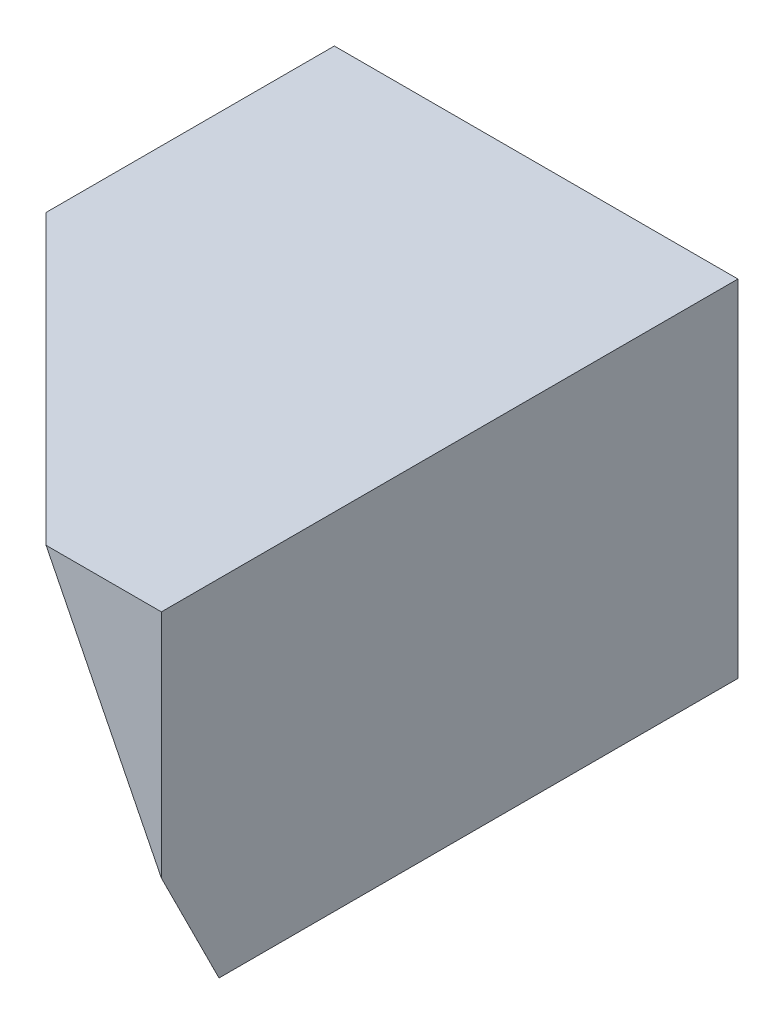
ISO-10303-21;
HEADER;
FILE_DESCRIPTION(('STEP AP214'),'2;1');
FILE_NAME('part.step','',(''),(''),'','','');
FILE_SCHEMA(('AUTOMOTIVE_DESIGN { 1 0 10303 214 1 1 1 1 }'));
ENDSEC;
DATA;
#1=APPLICATION_CONTEXT('core data for automotive mechanical design processes');
#2=APPLICATION_PROTOCOL_DEFINITION('international standard','automotive_design',2000,#1);
#3=PRODUCT_CONTEXT('',#1,'mechanical');
#4=PRODUCT('Part','Part','',(#3));
#5=PRODUCT_RELATED_PRODUCT_CATEGORY('part','',(#4));
#6=PRODUCT_DEFINITION_FORMATION('','',#4);
#7=PRODUCT_DEFINITION_CONTEXT('part definition',#1,'design');
#8=PRODUCT_DEFINITION('design','',#6,#7);
#9=PRODUCT_DEFINITION_SHAPE('','',#8);
#10=(LENGTH_UNIT() NAMED_UNIT(*) SI_UNIT(.MILLI.,.METRE.));
#11=(NAMED_UNIT(*) PLANE_ANGLE_UNIT() SI_UNIT($,.RADIAN.));
#12=(NAMED_UNIT(*) SI_UNIT($,.STERADIAN.) SOLID_ANGLE_UNIT());
#13=UNCERTAINTY_MEASURE_WITH_UNIT(LENGTH_MEASURE(1.E-05),#10,'distance_accuracy_value','');
#14=(GEOMETRIC_REPRESENTATION_CONTEXT(3) GLOBAL_UNCERTAINTY_ASSIGNED_CONTEXT((#13)) GLOBAL_UNIT_ASSIGNED_CONTEXT((#10,
#11,#12)) REPRESENTATION_CONTEXT('',''));
#15=CARTESIAN_POINT('',(0.,0.,0.));
#16=DIRECTION('',(0.,0.,1.));
#17=DIRECTION('',(1.,0.,0.));
#18=AXIS2_PLACEMENT_3D('',#15,#16,#17);
#19=CARTESIAN_POINT('',(0.,0.,5.));
#20=DIRECTION('',(1.,0.,0.));
#21=DIRECTION('',(0.,1.,0.));
#22=AXIS2_PLACEMENT_3D('',#19,#20,#21);
#23=PLANE('',#22);
#24=DIRECTION('',(0.,-0.894427190999916,-0.447213595499957));
#25=VECTOR('',#24,1.);
#26=CARTESIAN_POINT('',(0.,0.,0.));
#27=LINE('',#26,#25);
#28=CARTESIAN_POINT('',(0.,0.,0.));
#29=VERTEX_POINT('',#28);
#30=CARTESIAN_POINT('',(0.,-4.,-2.));
#31=VERTEX_POINT('',#30);
#32=EDGE_CURVE('E159',#29,#31,#27,.T.);
#33=ORIENTED_EDGE('',*,*,#32,.F.);
#34=DIRECTION('',(0.,0.,-1.));
#35=VECTOR('',#34,1.);
#36=CARTESIAN_POINT('',(0.,0.,5.));
#37=LINE('',#36,#35);
#38=CARTESIAN_POINT('',(0.,0.,-5.));
#39=VERTEX_POINT('',#38);
#40=EDGE_CURVE('E126',#29,#39,#37,.T.);
#41=ORIENTED_EDGE('',*,*,#40,.T.);
#42=DIRECTION('',(0.,-1.,0.));
#43=VECTOR('',#42,1.);
#44=CARTESIAN_POINT('',(0.,0.,-5.));
#45=LINE('',#44,#43);
#46=CARTESIAN_POINT('',(0.,-2.,-5.));
#47=VERTEX_POINT('',#46);
#48=EDGE_CURVE('E226',#39,#47,#45,.T.);
#49=ORIENTED_EDGE('',*,*,#48,.T.);
#50=DIRECTION('',(0.,0.,-1.));
#51=VECTOR('',#50,1.);
#52=CARTESIAN_POINT('',(0.,-2.,5.));
#53=LINE('',#52,#51);
#54=CARTESIAN_POINT('',(0.,-2.,-3.));
#55=VERTEX_POINT('',#54);
#56=EDGE_CURVE('E124',#55,#47,#53,.T.);
#57=ORIENTED_EDGE('',*,*,#56,.F.);
#58=DIRECTION('',(0.,1.,0.));
#59=VECTOR('',#58,1.);
#60=CARTESIAN_POINT('',(0.,-4.,-3.));
#61=LINE('',#60,#59);
#62=CARTESIAN_POINT('',(0.,-4.,-3.));
#63=VERTEX_POINT('',#62);
#64=EDGE_CURVE('E192',#63,#55,#61,.T.);
#65=ORIENTED_EDGE('',*,*,#64,.F.);
#66=DIRECTION('',(0.,0.,1.));
#67=VECTOR('',#66,1.);
#68=CARTESIAN_POINT('',(0.,-4.,-3.));
#69=LINE('',#68,#67);
#70=EDGE_CURVE('E211',#63,#31,#69,.T.);
#71=ORIENTED_EDGE('',*,*,#70,.T.);
#72=EDGE_LOOP('',(#33,#41,#49,#57,#65,#71));
#73=FACE_BOUND('',#72,.T.);
#74=ADVANCED_FACE('F34',(#73),#23,.F.);
#75=CARTESIAN_POINT('',(0.,0.,5.));
#76=DIRECTION('',(0.,0.,1.));
#77=DIRECTION('',(1.,0.,0.));
#78=AXIS2_PLACEMENT_3D('',#75,#76,#77);
#79=PLANE('',#78);
#80=DIRECTION('',(1.,0.,0.));
#81=VECTOR('',#80,1.);
#82=CARTESIAN_POINT('',(6.,-3.99899402286924,5.));
#83=LINE('',#82,#81);
#84=CARTESIAN_POINT('',(6.99949701143462,-3.99899402286923,5.));
#85=VERTEX_POINT('',#84);
#86=CARTESIAN_POINT('',(7.,-3.99899402286923,5.));
#87=VERTEX_POINT('',#86);
#88=EDGE_CURVE('E283',#85,#87,#83,.T.);
#89=ORIENTED_EDGE('',*,*,#88,.T.);
#90=DIRECTION('',(0.,-1.,0.));
#91=VECTOR('',#90,1.);
#92=CARTESIAN_POINT('',(7.,0.,5.));
#93=LINE('',#92,#91);
#94=CARTESIAN_POINT('',(7.,0.,5.));
#95=VERTEX_POINT('',#94);
#96=EDGE_CURVE('E110',#95,#87,#93,.T.);
#97=ORIENTED_EDGE('',*,*,#96,.F.);
#98=DIRECTION('',(-1.,0.,0.));
#99=VECTOR('',#98,1.);
#100=CARTESIAN_POINT('',(0.,0.,5.));
#101=LINE('',#100,#99);
#102=CARTESIAN_POINT('',(5.,0.,5.));
#103=VERTEX_POINT('',#102);
#104=EDGE_CURVE('E107',#95,#103,#101,.T.);
#105=ORIENTED_EDGE('',*,*,#104,.T.);
#106=DIRECTION('',(0.447213595499958,-0.894427190999916,0.));
#107=VECTOR('',#106,1.);
#108=CARTESIAN_POINT('',(4.,2.,5.));
#109=LINE('',#108,#107);
#110=EDGE_CURVE('E173',#103,#85,#109,.T.);
#111=ORIENTED_EDGE('',*,*,#110,.T.);
#112=EDGE_LOOP('',(#89,#97,#105,#111));
#113=FACE_BOUND('',#112,.T.);
#114=ADVANCED_FACE('F280',(#113),#79,.T.);
#115=CARTESIAN_POINT('',(5.,-2.,-3.));
#116=DIRECTION('',(0.,1.,0.));
#117=DIRECTION('',(0.,0.,1.));
#118=AXIS2_PLACEMENT_3D('',#115,#116,#117);
#119=PLANE('',#118);
#120=DIRECTION('',(0.707106781186548,0.,0.707106781186547));
#121=VECTOR('',#120,1.);
#122=CARTESIAN_POINT('',(1.5,-2.,0.5));
#123=LINE('',#122,#121);
#124=CARTESIAN_POINT('',(2.,-2.,0.999999999999999));
#125=VERTEX_POINT('',#124);
#126=CARTESIAN_POINT('',(5.,-2.,4.));
#127=VERTEX_POINT('',#126);
#128=EDGE_CURVE('E156',#125,#127,#123,.T.);
#129=ORIENTED_EDGE('',*,*,#128,.F.);
#130=DIRECTION('',(0.,0.,1.));
#131=VECTOR('',#130,1.);
#132=CARTESIAN_POINT('',(2.,-2.,-3.));
#133=LINE('',#132,#131);
#134=CARTESIAN_POINT('',(2.,-2.,-3.));
#135=VERTEX_POINT('',#134);
#136=EDGE_CURVE('E217',#135,#125,#133,.T.);
#137=ORIENTED_EDGE('',*,*,#136,.F.);
#138=DIRECTION('',(-1.,0.,0.));
#139=VECTOR('',#138,1.);
#140=CARTESIAN_POINT('',(5.,-2.,-3.));
#141=LINE('',#140,#139);
#142=CARTESIAN_POINT('',(5.,-2.,-3.));
#143=VERTEX_POINT('',#142);
#144=EDGE_CURVE('E183',#143,#135,#141,.T.);
#145=ORIENTED_EDGE('',*,*,#144,.F.);
#146=DIRECTION('',(0.,0.,1.));
#147=VECTOR('',#146,1.);
#148=CARTESIAN_POINT('',(5.,-2.,-3.));
#149=LINE('',#148,#147);
#150=EDGE_CURVE('E220',#143,#127,#149,.T.);
#151=ORIENTED_EDGE('',*,*,#150,.T.);
#152=EDGE_LOOP('',(#129,#137,#145,#151));
#153=FACE_BOUND('',#152,.T.);
#154=ADVANCED_FACE('F326',(#153),#119,.F.);
#155=CARTESIAN_POINT('',(0.,-6.,5.));
#156=DIRECTION('',(0.,-1.,0.));
#157=DIRECTION('',(0.,0.,-1.));
#158=AXIS2_PLACEMENT_3D('',#155,#156,#157);
#159=PLANE('',#158);
#160=DIRECTION('',(1.,0.,0.));
#161=VECTOR('',#160,1.);
#162=CARTESIAN_POINT('',(6.,-6.,4.));
#163=LINE('',#162,#161);
#164=CARTESIAN_POINT('',(6.99909462058231,-6.,4.));
#165=VERTEX_POINT('',#164);
#166=CARTESIAN_POINT('',(7.,-6.,4.));
#167=VERTEX_POINT('',#166);
#168=EDGE_CURVE('E138',#165,#167,#163,.T.);
#169=ORIENTED_EDGE('',*,*,#168,.F.);
#170=DIRECTION('',(0.624695047554424,0.,-0.78086880944303));
#171=VECTOR('',#170,1.);
#172=CARTESIAN_POINT('',(3.77993574425751,-6.,8.023948595406));
#173=LINE('',#172,#171);
#174=CARTESIAN_POINT('',(6.99949701143462,-6.,3.99949701143462));
#175=VERTEX_POINT('',#174);
#176=EDGE_CURVE('E43',#165,#175,#173,.T.);
#177=ORIENTED_EDGE('',*,*,#176,.T.);
#178=DIRECTION('',(-0.707106781186548,0.,-0.707106781186547));
#179=VECTOR('',#178,1.);
#180=CARTESIAN_POINT('',(4.,-6.,0.999999999999999));
#181=LINE('',#180,#179);
#182=CARTESIAN_POINT('',(5.,-6.,2.));
#183=VERTEX_POINT('',#182);
#184=EDGE_CURVE('E134',#175,#183,#181,.T.);
#185=ORIENTED_EDGE('',*,*,#184,.T.);
#186=DIRECTION('',(0.,0.,1.));
#187=VECTOR('',#186,1.);
#188=CARTESIAN_POINT('',(5.,-6.,-3.));
#189=LINE('',#188,#187);
#190=CARTESIAN_POINT('',(5.,-6.,-3.));
#191=VERTEX_POINT('',#190);
#192=EDGE_CURVE('E210',#191,#183,#189,.T.);
#193=ORIENTED_EDGE('',*,*,#192,.F.);
#194=DIRECTION('',(1.,0.,0.));
#195=VECTOR('',#194,1.);
#196=CARTESIAN_POINT('',(4.,-6.,-3.));
#197=LINE('',#196,#195);
#198=CARTESIAN_POINT('',(4.,-6.,-3.));
#199=VERTEX_POINT('',#198);
#200=EDGE_CURVE('E177',#199,#191,#197,.T.);
#201=ORIENTED_EDGE('',*,*,#200,.F.);
#202=DIRECTION('',(0.,0.,-1.));
#203=VECTOR('',#202,1.);
#204=CARTESIAN_POINT('',(4.,-6.,5.));
#205=LINE('',#204,#203);
#206=CARTESIAN_POINT('',(4.,-6.,-5.));
#207=VERTEX_POINT('',#206);
#208=EDGE_CURVE('E90',#199,#207,#205,.T.);
#209=ORIENTED_EDGE('',*,*,#208,.T.);
#210=DIRECTION('',(-1.,0.,0.));
#211=VECTOR('',#210,1.);
#212=CARTESIAN_POINT('',(0.,-6.,-5.));
#213=LINE('',#212,#211);
#214=CARTESIAN_POINT('',(7.,-6.,-5.));
#215=VERTEX_POINT('',#214);
#216=EDGE_CURVE('E93',#215,#207,#213,.T.);
#217=ORIENTED_EDGE('',*,*,#216,.F.);
#218=DIRECTION('',(0.,0.,-1.));
#219=VECTOR('',#218,1.);
#220=CARTESIAN_POINT('',(7.,-6.,5.));
#221=LINE('',#220,#219);
#222=EDGE_CURVE('E80',#167,#215,#221,.T.);
#223=ORIENTED_EDGE('',*,*,#222,.F.);
#224=EDGE_LOOP('',(#169,#177,#185,#193,#201,#209,#217,#223));
#225=FACE_BOUND('',#224,.T.);
#226=ADVANCED_FACE('F94',(#225),#159,.T.);
#227=CARTESIAN_POINT('',(2.,-4.,-3.));
#228=DIRECTION('',(0.,1.,0.));
#229=DIRECTION('',(0.,0.,1.));
#230=AXIS2_PLACEMENT_3D('',#227,#228,#229);
#231=PLANE('',#230);
#232=DIRECTION('',(0.707106781186548,0.,0.707106781186547));
#233=VECTOR('',#232,1.);
#234=CARTESIAN_POINT('',(0.5,-4.,-1.5));
#235=LINE('',#234,#233);
#236=CARTESIAN_POINT('',(2.,-4.,0.));
#237=VERTEX_POINT('',#236);
#238=EDGE_CURVE('E170',#31,#237,#235,.T.);
#239=ORIENTED_EDGE('',*,*,#238,.F.);
#240=ORIENTED_EDGE('',*,*,#70,.F.);
#241=DIRECTION('',(-1.,0.,0.));
#242=VECTOR('',#241,1.);
#243=CARTESIAN_POINT('',(2.,-4.,-3.));
#244=LINE('',#243,#242);
#245=CARTESIAN_POINT('',(2.,-4.,-3.));
#246=VERTEX_POINT('',#245);
#247=EDGE_CURVE('E189',#246,#63,#244,.T.);
#248=ORIENTED_EDGE('',*,*,#247,.F.);
#249=DIRECTION('',(0.,0.,1.));
#250=VECTOR('',#249,1.);
#251=CARTESIAN_POINT('',(2.,-4.,-3.));
#252=LINE('',#251,#250);
#253=EDGE_CURVE('E214',#246,#237,#252,.T.);
#254=ORIENTED_EDGE('',*,*,#253,.T.);
#255=EDGE_LOOP('',(#239,#240,#248,#254));
#256=FACE_BOUND('',#255,.T.);
#257=ADVANCED_FACE('F333',(#256),#231,.F.);
#258=CARTESIAN_POINT('',(2.,-2.,-3.));
#259=DIRECTION('',(-1.,0.,0.));
#260=DIRECTION('',(0.,-1.,0.));
#261=AXIS2_PLACEMENT_3D('',#258,#259,#260);
#262=PLANE('',#261);
#263=DIRECTION('',(0.,0.894427190999916,0.447213595499958));
#264=VECTOR('',#263,1.);
#265=CARTESIAN_POINT('',(2.,-3.6,0.2));
#266=LINE('',#265,#264);
#267=EDGE_CURVE('E167',#237,#125,#266,.T.);
#268=ORIENTED_EDGE('',*,*,#267,.F.);
#269=ORIENTED_EDGE('',*,*,#253,.F.);
#270=DIRECTION('',(0.,-1.,0.));
#271=VECTOR('',#270,1.);
#272=CARTESIAN_POINT('',(2.,-2.,-3.));
#273=LINE('',#272,#271);
#274=EDGE_CURVE('E186',#135,#246,#273,.T.);
#275=ORIENTED_EDGE('',*,*,#274,.F.);
#276=ORIENTED_EDGE('',*,*,#136,.T.);
#277=EDGE_LOOP('',(#268,#269,#275,#276));
#278=FACE_BOUND('',#277,.T.);
#279=ADVANCED_FACE('F329',(#278),#262,.F.);
#280=CARTESIAN_POINT('',(5.,-6.,-3.));
#281=DIRECTION('',(1.,0.,0.));
#282=DIRECTION('',(0.,0.,-1.));
#283=AXIS2_PLACEMENT_3D('',#280,#281,#282);
#284=PLANE('',#283);
#285=DIRECTION('',(0.,-0.894427190999916,-0.447213595499958));
#286=VECTOR('',#285,1.);
#287=CARTESIAN_POINT('',(5.,-8.,1.));
#288=LINE('',#287,#286);
#289=EDGE_CURVE('E155',#127,#183,#288,.T.);
#290=ORIENTED_EDGE('',*,*,#289,.F.);
#291=ORIENTED_EDGE('',*,*,#150,.F.);
#292=DIRECTION('',(0.,1.,0.));
#293=VECTOR('',#292,1.);
#294=CARTESIAN_POINT('',(5.,-6.,-3.));
#295=LINE('',#294,#293);
#296=EDGE_CURVE('E180',#191,#143,#295,.T.);
#297=ORIENTED_EDGE('',*,*,#296,.F.);
#298=ORIENTED_EDGE('',*,*,#192,.T.);
#299=EDGE_LOOP('',(#290,#291,#297,#298));
#300=FACE_BOUND('',#299,.T.);
#301=ADVANCED_FACE('F321',(#300),#284,.F.);
#302=CARTESIAN_POINT('',(0.,0.,5.));
#303=DIRECTION('',(0.,-1.,0.));
#304=DIRECTION('',(1.,0.,0.));
#305=AXIS2_PLACEMENT_3D('',#302,#303,#304);
#306=PLANE('',#305);
#307=DIRECTION('',(-0.707106781186548,0.,-0.707106781186548));
#308=VECTOR('',#307,1.);
#309=CARTESIAN_POINT('',(0.,0.,0.));
#310=LINE('',#309,#308);
#311=EDGE_CURVE('E175',#103,#29,#310,.T.);
#312=ORIENTED_EDGE('',*,*,#311,.F.);
#313=ORIENTED_EDGE('',*,*,#104,.F.);
#314=DIRECTION('',(0.,0.,-1.));
#315=VECTOR('',#314,1.);
#316=CARTESIAN_POINT('',(7.,0.,5.));
#317=LINE('',#316,#315);
#318=CARTESIAN_POINT('',(7.,0.,-5.));
#319=VERTEX_POINT('',#318);
#320=EDGE_CURVE('E50',#95,#319,#317,.T.);
#321=ORIENTED_EDGE('',*,*,#320,.T.);
#322=DIRECTION('',(-1.,0.,0.));
#323=VECTOR('',#322,1.);
#324=CARTESIAN_POINT('',(0.,0.,-5.));
#325=LINE('',#324,#323);
#326=EDGE_CURVE('E106',#319,#39,#325,.T.);
#327=ORIENTED_EDGE('',*,*,#326,.T.);
#328=ORIENTED_EDGE('',*,*,#40,.F.);
#329=EDGE_LOOP('',(#312,#313,#321,#327,#328));
#330=FACE_BOUND('',#329,.T.);
#331=ADVANCED_FACE('F36',(#330),#306,.F.);
#332=CARTESIAN_POINT('',(0.,-2.,5.));
#333=DIRECTION('',(0.,1.,0.));
#334=DIRECTION('',(0.,0.,1.));
#335=AXIS2_PLACEMENT_3D('',#332,#333,#334);
#336=PLANE('',#335);
#337=DIRECTION('',(0.,0.,-1.));
#338=VECTOR('',#337,1.);
#339=CARTESIAN_POINT('',(-0.999999999999998,-2.,5.));
#340=LINE('',#339,#338);
#341=CARTESIAN_POINT('',(-0.999999999999998,-2.,-3.));
#342=VERTEX_POINT('',#341);
#343=CARTESIAN_POINT('',(-0.999999999999998,-2.,-5.));
#344=VERTEX_POINT('',#343);
#345=EDGE_CURVE('E122',#342,#344,#340,.T.);
#346=ORIENTED_EDGE('',*,*,#345,.F.);
#347=DIRECTION('',(-1.,0.,0.));
#348=VECTOR('',#347,1.);
#349=CARTESIAN_POINT('',(0.,-2.,-3.));
#350=LINE('',#349,#348);
#351=EDGE_CURVE('E195',#55,#342,#350,.T.);
#352=ORIENTED_EDGE('',*,*,#351,.F.);
#353=ORIENTED_EDGE('',*,*,#56,.T.);
#354=DIRECTION('',(1.,0.,0.));
#355=VECTOR('',#354,1.);
#356=CARTESIAN_POINT('',(0.,-2.,-5.));
#357=LINE('',#356,#355);
#358=EDGE_CURVE('E229',#344,#47,#357,.T.);
#359=ORIENTED_EDGE('',*,*,#358,.F.);
#360=EDGE_LOOP('',(#346,#352,#353,#359));
#361=FACE_BOUND('',#360,.T.);
#362=ADVANCED_FACE('F266',(#361),#336,.T.);
#363=CARTESIAN_POINT('',(-0.999999999999998,0.,5.));
#364=DIRECTION('',(-1.,0.,0.));
#365=DIRECTION('',(0.,0.,1.));
#366=AXIS2_PLACEMENT_3D('',#363,#364,#365);
#367=PLANE('',#366);
#368=DIRECTION('',(0.,0.,-1.));
#369=VECTOR('',#368,1.);
#370=CARTESIAN_POINT('',(-0.999999999999998,-5.,5.));
#371=LINE('',#370,#369);
#372=CARTESIAN_POINT('',(-0.999999999999998,-5.,-3.));
#373=VERTEX_POINT('',#372);
#374=CARTESIAN_POINT('',(-0.999999999999998,-5.,-5.));
#375=VERTEX_POINT('',#374);
#376=EDGE_CURVE('E120',#373,#375,#371,.T.);
#377=ORIENTED_EDGE('',*,*,#376,.F.);
#378=DIRECTION('',(0.,-1.,0.));
#379=VECTOR('',#378,1.);
#380=CARTESIAN_POINT('',(-0.999999999999998,-2.,-3.));
#381=LINE('',#380,#379);
#382=EDGE_CURVE('E198',#342,#373,#381,.T.);
#383=ORIENTED_EDGE('',*,*,#382,.F.);
#384=ORIENTED_EDGE('',*,*,#345,.T.);
#385=DIRECTION('',(0.,1.,0.));
#386=VECTOR('',#385,1.);
#387=CARTESIAN_POINT('',(-0.999999999999998,0.,-5.));
#388=LINE('',#387,#386);
#389=EDGE_CURVE('E232',#375,#344,#388,.T.);
#390=ORIENTED_EDGE('',*,*,#389,.F.);
#391=EDGE_LOOP('',(#377,#383,#384,#390));
#392=FACE_BOUND('',#391,.T.);
#393=ADVANCED_FACE('F259',(#392),#367,.T.);
#394=CARTESIAN_POINT('',(-2.61538461538461,-3.92307692307693,5.));
#395=DIRECTION('',(-0.554700196225229,-0.832050294337844,0.));
#396=DIRECTION('',(0.832050294337844,-0.554700196225229,0.));
#397=AXIS2_PLACEMENT_3D('',#394,#395,#396);
#398=PLANE('',#397);
#399=DIRECTION('',(0.,0.,-1.));
#400=VECTOR('',#399,1.);
#401=CARTESIAN_POINT('',(2.,-7.,5.));
#402=LINE('',#401,#400);
#403=CARTESIAN_POINT('',(2.,-7.,-3.));
#404=VERTEX_POINT('',#403);
#405=CARTESIAN_POINT('',(2.,-7.,-5.));
#406=VERTEX_POINT('',#405);
#407=EDGE_CURVE('E118',#404,#406,#402,.T.);
#408=ORIENTED_EDGE('',*,*,#407,.F.);
#409=DIRECTION('',(0.832050294337844,-0.554700196225229,0.));
#410=VECTOR('',#409,1.);
#411=CARTESIAN_POINT('',(-0.999999999999998,-5.,-3.));
#412=LINE('',#411,#410);
#413=EDGE_CURVE('E201',#373,#404,#412,.T.);
#414=ORIENTED_EDGE('',*,*,#413,.F.);
#415=ORIENTED_EDGE('',*,*,#376,.T.);
#416=DIRECTION('',(-0.832050294337844,0.554700196225229,0.));
#417=VECTOR('',#416,1.);
#418=CARTESIAN_POINT('',(-2.61538461538461,-3.92307692307693,-5.));
#419=LINE('',#418,#417);
#420=EDGE_CURVE('E235',#406,#375,#419,.T.);
#421=ORIENTED_EDGE('',*,*,#420,.F.);
#422=EDGE_LOOP('',(#408,#414,#415,#421));
#423=FACE_BOUND('',#422,.T.);
#424=ADVANCED_FACE('F254',(#423),#398,.T.);
#425=CARTESIAN_POINT('',(0.,-7.,5.));
#426=DIRECTION('',(0.,-1.,0.));
#427=DIRECTION('',(0.,0.,-1.));
#428=AXIS2_PLACEMENT_3D('',#425,#426,#427);
#429=PLANE('',#428);
#430=DIRECTION('',(0.,0.,-1.));
#431=VECTOR('',#430,1.);
#432=CARTESIAN_POINT('',(4.,-7.,5.));
#433=LINE('',#432,#431);
#434=CARTESIAN_POINT('',(4.,-7.,-3.));
#435=VERTEX_POINT('',#434);
#436=CARTESIAN_POINT('',(4.,-7.,-5.));
#437=VERTEX_POINT('',#436);
#438=EDGE_CURVE('E116',#435,#437,#433,.T.);
#439=ORIENTED_EDGE('',*,*,#438,.F.);
#440=DIRECTION('',(1.,0.,0.));
#441=VECTOR('',#440,1.);
#442=CARTESIAN_POINT('',(2.,-7.,-3.));
#443=LINE('',#442,#441);
#444=EDGE_CURVE('E204',#404,#435,#443,.T.);
#445=ORIENTED_EDGE('',*,*,#444,.F.);
#446=ORIENTED_EDGE('',*,*,#407,.T.);
#447=DIRECTION('',(-1.,0.,0.));
#448=VECTOR('',#447,1.);
#449=CARTESIAN_POINT('',(0.,-7.,-5.));
#450=LINE('',#449,#448);
#451=EDGE_CURVE('E238',#437,#406,#450,.T.);
#452=ORIENTED_EDGE('',*,*,#451,.F.);
#453=EDGE_LOOP('',(#439,#445,#446,#452));
#454=FACE_BOUND('',#453,.T.);
#455=ADVANCED_FACE('F248',(#454),#429,.T.);
#456=CARTESIAN_POINT('',(4.,0.,5.));
#457=DIRECTION('',(1.,0.,0.));
#458=DIRECTION('',(0.,0.,-1.));
#459=AXIS2_PLACEMENT_3D('',#456,#457,#458);
#460=PLANE('',#459);
#461=ORIENTED_EDGE('',*,*,#208,.F.);
#462=DIRECTION('',(0.,1.,0.));
#463=VECTOR('',#462,1.);
#464=CARTESIAN_POINT('',(4.,-7.,-3.));
#465=LINE('',#464,#463);
#466=EDGE_CURVE('E207',#435,#199,#465,.T.);
#467=ORIENTED_EDGE('',*,*,#466,.F.);
#468=ORIENTED_EDGE('',*,*,#438,.T.);
#469=DIRECTION('',(0.,-1.,0.));
#470=VECTOR('',#469,1.);
#471=CARTESIAN_POINT('',(4.,0.,-5.));
#472=LINE('',#471,#470);
#473=EDGE_CURVE('E100',#207,#437,#472,.T.);
#474=ORIENTED_EDGE('',*,*,#473,.F.);
#475=EDGE_LOOP('',(#461,#467,#468,#474));
#476=FACE_BOUND('',#475,.T.);
#477=ADVANCED_FACE('F242',(#476),#460,.T.);
#478=CARTESIAN_POINT('',(7.,0.,5.));
#479=DIRECTION('',(1.,0.,0.));
#480=DIRECTION('',(0.,1.,0.));
#481=AXIS2_PLACEMENT_3D('',#478,#479,#480);
#482=PLANE('',#481);
#483=DIRECTION('',(0.,0.894517114048067,0.447033704182489));
#484=VECTOR('',#483,1.);
#485=CARTESIAN_POINT('',(7.,-3.99899402286923,5.));
#486=LINE('',#485,#484);
#487=EDGE_CURVE('E87',#167,#87,#486,.T.);
#488=ORIENTED_EDGE('',*,*,#487,.F.);
#489=ORIENTED_EDGE('',*,*,#222,.T.);
#490=DIRECTION('',(0.,-1.,0.));
#491=VECTOR('',#490,1.);
#492=CARTESIAN_POINT('',(7.,0.,-5.));
#493=LINE('',#492,#491);
#494=EDGE_CURVE('E84',#319,#215,#493,.T.);
#495=ORIENTED_EDGE('',*,*,#494,.F.);
#496=ORIENTED_EDGE('',*,*,#320,.F.);
#497=ORIENTED_EDGE('',*,*,#96,.T.);
#498=EDGE_LOOP('',(#488,#489,#495,#496,#497));
#499=FACE_BOUND('',#498,.T.);
#500=ADVANCED_FACE('F82',(#499),#482,.T.);
#501=CARTESIAN_POINT('',(0.,0.,-5.));
#502=DIRECTION('',(0.,0.,1.));
#503=DIRECTION('',(1.,0.,0.));
#504=AXIS2_PLACEMENT_3D('',#501,#502,#503);
#505=PLANE('',#504);
#506=ORIENTED_EDGE('',*,*,#326,.F.);
#507=ORIENTED_EDGE('',*,*,#494,.T.);
#508=ORIENTED_EDGE('',*,*,#216,.T.);
#509=ORIENTED_EDGE('',*,*,#473,.T.);
#510=ORIENTED_EDGE('',*,*,#451,.T.);
#511=ORIENTED_EDGE('',*,*,#420,.T.);
#512=ORIENTED_EDGE('',*,*,#389,.T.);
#513=ORIENTED_EDGE('',*,*,#358,.T.);
#514=ORIENTED_EDGE('',*,*,#48,.F.);
#515=EDGE_LOOP('',(#506,#507,#508,#509,#510,#511,#512,#513,#514));
#516=FACE_BOUND('',#515,.T.);
#517=ADVANCED_FACE('F103',(#516),#505,.F.);
#518=CARTESIAN_POINT('',(0.,0.,-3.));
#519=DIRECTION('',(0.,0.,1.));
#520=DIRECTION('',(1.,0.,0.));
#521=AXIS2_PLACEMENT_3D('',#518,#519,#520);
#522=PLANE('',#521);
#523=ORIENTED_EDGE('',*,*,#200,.T.);
#524=ORIENTED_EDGE('',*,*,#296,.T.);
#525=ORIENTED_EDGE('',*,*,#144,.T.);
#526=ORIENTED_EDGE('',*,*,#274,.T.);
#527=ORIENTED_EDGE('',*,*,#247,.T.);
#528=ORIENTED_EDGE('',*,*,#64,.T.);
#529=ORIENTED_EDGE('',*,*,#351,.T.);
#530=ORIENTED_EDGE('',*,*,#382,.T.);
#531=ORIENTED_EDGE('',*,*,#413,.T.);
#532=ORIENTED_EDGE('',*,*,#444,.T.);
#533=ORIENTED_EDGE('',*,*,#466,.T.);
#534=EDGE_LOOP('',(#523,#524,#525,#526,#527,#528,#529,#530,#531,#532,#533));
#535=FACE_BOUND('',#534,.T.);
#536=ADVANCED_FACE('F319',(#535),#522,.T.);
#537=CARTESIAN_POINT('',(0.,0.,0.));
#538=DIRECTION('',(-0.666666666666667,-0.333333333333333,0.666666666666667));
#539=DIRECTION('',(0.707106781186548,0.,0.707106781186547));
#540=AXIS2_PLACEMENT_3D('',#537,#538,#539);
#541=PLANE('',#540);
#542=ORIENTED_EDGE('',*,*,#311,.T.);
#543=ORIENTED_EDGE('',*,*,#32,.T.);
#544=ORIENTED_EDGE('',*,*,#238,.T.);
#545=ORIENTED_EDGE('',*,*,#267,.T.);
#546=ORIENTED_EDGE('',*,*,#128,.T.);
#547=ORIENTED_EDGE('',*,*,#289,.T.);
#548=ORIENTED_EDGE('',*,*,#184,.F.);
#549=DIRECTION('',(0.,0.894427190999916,0.447213595499957));
#550=VECTOR('',#549,1.);
#551=CARTESIAN_POINT('',(6.99949701143462,-6.79979880457385,3.5995976091477));
#552=LINE('',#551,#550);
#553=EDGE_CURVE('E151',#175,#85,#552,.T.);
#554=ORIENTED_EDGE('',*,*,#553,.T.);
#555=ORIENTED_EDGE('',*,*,#110,.F.);
#556=EDGE_LOOP('',(#542,#543,#544,#545,#546,#547,#548,#554,#555));
#557=FACE_BOUND('',#556,.T.);
#558=ADVANCED_FACE('F149',(#557),#541,.T.);
#559=CARTESIAN_POINT('',(0.332830344767953,-10.1331321379072,10.2662642758144));
#560=DIRECTION('',(-0.74535599249993,0.298142396999971,-0.596284793999944));
#561=DIRECTION('',(-0.624695047554424,0.,0.78086880944303));
#562=AXIS2_PLACEMENT_3D('',#559,#560,#561);
#563=PLANE('',#562);
#564=DIRECTION('',(-0.000179882270324174,-0.89451709957584,-0.447033696950013));
#565=VECTOR('',#564,1.);
#566=CARTESIAN_POINT('',(6.99893324365924,-6.80249385836838,3.59895479196965));
#567=LINE('',#566,#565);
#568=EDGE_CURVE('E11',#85,#165,#567,.T.);
#569=ORIENTED_EDGE('',*,*,#568,.F.);
#570=ORIENTED_EDGE('',*,*,#553,.F.);
#571=ORIENTED_EDGE('',*,*,#176,.F.);
#572=EDGE_LOOP('',(#569,#570,#571));
#573=FACE_BOUND('',#572,.T.);
#574=ADVANCED_FACE('F158',(#573),#563,.T.);
#575=CARTESIAN_POINT('',(6.,-3.99899402286924,5.));
#576=DIRECTION('',(0.,0.447033704182489,-0.894517114048067));
#577=DIRECTION('',(0.,0.894517114048067,0.447033704182489));
#578=AXIS2_PLACEMENT_3D('',#575,#576,#577);
#579=PLANE('',#578);
#580=ORIENTED_EDGE('',*,*,#568,.T.);
#581=ORIENTED_EDGE('',*,*,#168,.T.);
#582=ORIENTED_EDGE('',*,*,#487,.T.);
#583=ORIENTED_EDGE('',*,*,#88,.F.);
#584=EDGE_LOOP('',(#580,#581,#582,#583));
#585=FACE_BOUND('',#584,.T.);
#586=ADVANCED_FACE('F404',(#585),#579,.F.);
#587=CLOSED_SHELL('',(#74,#114,#154,#226,#257,#279,#301,#331,#362,#393,#424,#455,#477,#500,#517,
#536,#558,#574,#586));
#588=MANIFOLD_SOLID_BREP('B2',#587);
#589=ADVANCED_BREP_SHAPE_REPRESENTATION('',(#18,#588),#14);
#590=SHAPE_DEFINITION_REPRESENTATION(#9,#589);
ENDSEC;
END-ISO-10303-21;
